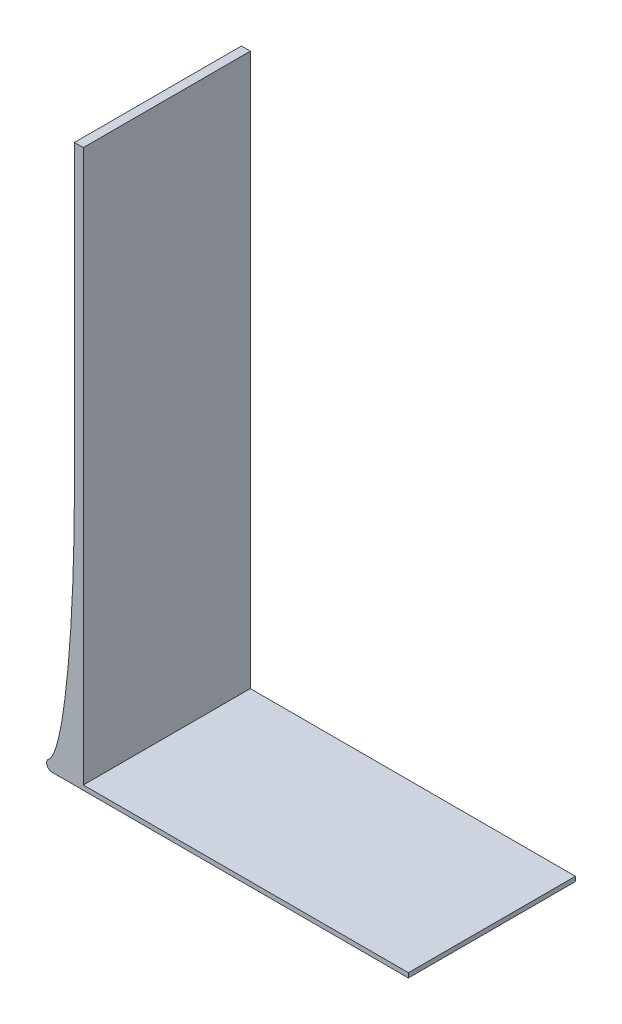
ISO-10303-21;
HEADER;
FILE_DESCRIPTION(('STEP AP214'),'2;1');
FILE_NAME('part.step','',(''),(''),'','','');
FILE_SCHEMA(('AUTOMOTIVE_DESIGN { 1 0 10303 214 1 1 1 1 }'));
ENDSEC;
DATA;
#1=APPLICATION_CONTEXT('core data for automotive mechanical design processes');
#2=APPLICATION_PROTOCOL_DEFINITION('international standard','automotive_design',2000,#1);
#3=PRODUCT_CONTEXT('',#1,'mechanical');
#4=PRODUCT('Part','Part','',(#3));
#5=PRODUCT_RELATED_PRODUCT_CATEGORY('part','',(#4));
#6=PRODUCT_DEFINITION_FORMATION('','',#4);
#7=PRODUCT_DEFINITION_CONTEXT('part definition',#1,'design');
#8=PRODUCT_DEFINITION('design','',#6,#7);
#9=PRODUCT_DEFINITION_SHAPE('','',#8);
#10=(LENGTH_UNIT() NAMED_UNIT(*) SI_UNIT(.MILLI.,.METRE.));
#11=(NAMED_UNIT(*) PLANE_ANGLE_UNIT() SI_UNIT($,.RADIAN.));
#12=(NAMED_UNIT(*) SI_UNIT($,.STERADIAN.) SOLID_ANGLE_UNIT());
#13=UNCERTAINTY_MEASURE_WITH_UNIT(LENGTH_MEASURE(1.E-05),#10,'distance_accuracy_value','');
#14=(GEOMETRIC_REPRESENTATION_CONTEXT(3) GLOBAL_UNCERTAINTY_ASSIGNED_CONTEXT((#13)) GLOBAL_UNIT_ASSIGNED_CONTEXT((#10,
#11,#12)) REPRESENTATION_CONTEXT('',''));
#15=CARTESIAN_POINT('',(0.,0.,0.));
#16=DIRECTION('',(0.,0.,1.));
#17=DIRECTION('',(1.,0.,0.));
#18=AXIS2_PLACEMENT_3D('',#15,#16,#17);
#19=CARTESIAN_POINT('',(0.,1.65,60.));
#20=DIRECTION('',(0.,1.,0.));
#21=DIRECTION('',(0.,0.,1.));
#22=AXIS2_PLACEMENT_3D('',#19,#20,#21);
#23=PLANE('',#22);
#24=DIRECTION('',(1.,0.,0.));
#25=VECTOR('',#24,1.);
#26=CARTESIAN_POINT('',(0.,1.65,0.));
#27=LINE('',#26,#25);
#28=CARTESIAN_POINT('',(3.2,1.65,0.));
#29=VERTEX_POINT('',#28);
#30=CARTESIAN_POINT('',(120.,1.65,0.));
#31=VERTEX_POINT('',#30);
#32=EDGE_CURVE('E188',#29,#31,#27,.T.);
#33=ORIENTED_EDGE('',*,*,#32,.F.);
#34=DIRECTION('',(0.,0.,1.));
#35=VECTOR('',#34,1.);
#36=CARTESIAN_POINT('',(3.2,1.65,60.));
#37=LINE('',#36,#35);
#38=CARTESIAN_POINT('',(3.2,1.65,60.));
#39=VERTEX_POINT('',#38);
#40=EDGE_CURVE('E159',#29,#39,#37,.T.);
#41=ORIENTED_EDGE('',*,*,#40,.T.);
#42=DIRECTION('',(1.,0.,0.));
#43=VECTOR('',#42,1.);
#44=CARTESIAN_POINT('',(0.,1.65,60.));
#45=LINE('',#44,#43);
#46=CARTESIAN_POINT('',(120.,1.65,60.));
#47=VERTEX_POINT('',#46);
#48=EDGE_CURVE('E146',#39,#47,#45,.T.);
#49=ORIENTED_EDGE('',*,*,#48,.T.);
#50=DIRECTION('',(0.,0.,-1.));
#51=VECTOR('',#50,1.);
#52=CARTESIAN_POINT('',(120.,1.65,60.));
#53=LINE('',#52,#51);
#54=EDGE_CURVE('E192',#47,#31,#53,.T.);
#55=ORIENTED_EDGE('',*,*,#54,.T.);
#56=EDGE_LOOP('',(#33,#41,#49,#55));
#57=FACE_BOUND('',#56,.T.);
#58=ADVANCED_FACE('F67',(#57),#23,.T.);
#59=CARTESIAN_POINT('',(0.,0.,60.));
#60=DIRECTION('',(0.,1.,0.));
#61=DIRECTION('',(0.,0.,1.));
#62=AXIS2_PLACEMENT_3D('',#59,#60,#61);
#63=PLANE('',#62);
#64=DIRECTION('',(1.,0.,0.));
#65=VECTOR('',#64,1.);
#66=CARTESIAN_POINT('',(0.,0.,60.));
#67=LINE('',#66,#65);
#68=CARTESIAN_POINT('',(-8.,0.,60.));
#69=VERTEX_POINT('',#68);
#70=CARTESIAN_POINT('',(120.,0.,60.));
#71=VERTEX_POINT('',#70);
#72=EDGE_CURVE('E185',#69,#71,#67,.T.);
#73=ORIENTED_EDGE('',*,*,#72,.F.);
#74=DIRECTION('',(0.,0.,-1.));
#75=VECTOR('',#74,1.);
#76=CARTESIAN_POINT('',(-8.,0.,0.));
#77=LINE('',#76,#75);
#78=CARTESIAN_POINT('',(-8.,0.,0.));
#79=VERTEX_POINT('',#78);
#80=EDGE_CURVE('E213',#69,#79,#77,.T.);
#81=ORIENTED_EDGE('',*,*,#80,.T.);
#82=DIRECTION('',(1.,0.,0.));
#83=VECTOR('',#82,1.);
#84=CARTESIAN_POINT('',(0.,0.,0.));
#85=LINE('',#84,#83);
#86=CARTESIAN_POINT('',(120.,0.,0.));
#87=VERTEX_POINT('',#86);
#88=EDGE_CURVE('E184',#79,#87,#85,.T.);
#89=ORIENTED_EDGE('',*,*,#88,.T.);
#90=DIRECTION('',(0.,0.,-1.));
#91=VECTOR('',#90,1.);
#92=CARTESIAN_POINT('',(120.,0.,60.));
#93=LINE('',#92,#91);
#94=EDGE_CURVE('E174',#71,#87,#93,.T.);
#95=ORIENTED_EDGE('',*,*,#94,.F.);
#96=EDGE_LOOP('',(#73,#81,#89,#95));
#97=FACE_BOUND('',#96,.T.);
#98=ADVANCED_FACE('F253',(#97),#63,.F.);
#99=CARTESIAN_POINT('',(120.,1.65,60.));
#100=DIRECTION('',(1.,0.,0.));
#101=DIRECTION('',(0.,0.,-1.));
#102=AXIS2_PLACEMENT_3D('',#99,#100,#101);
#103=PLANE('',#102);
#104=DIRECTION('',(0.,-1.,0.));
#105=VECTOR('',#104,1.);
#106=CARTESIAN_POINT('',(120.,1.65,0.));
#107=LINE('',#106,#105);
#108=EDGE_CURVE('E194',#31,#87,#107,.T.);
#109=ORIENTED_EDGE('',*,*,#108,.F.);
#110=ORIENTED_EDGE('',*,*,#54,.F.);
#111=DIRECTION('',(0.,-1.,0.));
#112=VECTOR('',#111,1.);
#113=CARTESIAN_POINT('',(120.,1.65,60.));
#114=LINE('',#113,#112);
#115=EDGE_CURVE('E187',#47,#71,#114,.T.);
#116=ORIENTED_EDGE('',*,*,#115,.T.);
#117=ORIENTED_EDGE('',*,*,#94,.T.);
#118=EDGE_LOOP('',(#109,#110,#116,#117));
#119=FACE_BOUND('',#118,.T.);
#120=ADVANCED_FACE('F254',(#119),#103,.T.);
#121=CARTESIAN_POINT('',(0.,0.,60.));
#122=DIRECTION('',(0.,0.,-1.));
#123=DIRECTION('',(-1.,0.,0.));
#124=AXIS2_PLACEMENT_3D('',#121,#122,#123);
#125=PLANE('',#124);
#126=CARTESIAN_POINT('',(-8.00000000000001,1.91675235510532,60.));
#127=DIRECTION('',(0.,0.,-1.));
#128=DIRECTION('',(-1.,0.,0.));
#129=AXIS2_PLACEMENT_3D('',#126,#127,#128);
#130=CIRCLE('',#129,2.);
#131=CARTESIAN_POINT('',(-9.19087207248773,3.51696670228949,60.));
#132=VERTEX_POINT('',#131);
#133=CARTESIAN_POINT('',(-9.99956681743944,1.95837617755283,60.));
#134=VERTEX_POINT('',#133);
#135=EDGE_CURVE('E84',#132,#134,#130,.F.);
#136=ORIENTED_EDGE('',*,*,#135,.T.);
#137=CARTESIAN_POINT('',(-8.,2.,60.));
#138=DIRECTION('',(0.,0.,-1.));
#139=DIRECTION('',(-1.,0.,0.));
#140=AXIS2_PLACEMENT_3D('',#137,#138,#139);
#141=CIRCLE('',#140,2.);
#142=EDGE_CURVE('E76',#134,#69,#141,.F.);
#143=ORIENTED_EDGE('',*,*,#142,.T.);
#144=ORIENTED_EDGE('',*,*,#72,.T.);
#145=ORIENTED_EDGE('',*,*,#115,.F.);
#146=ORIENTED_EDGE('',*,*,#48,.F.);
#147=DIRECTION('',(0.,1.,0.));
#148=VECTOR('',#147,1.);
#149=CARTESIAN_POINT('',(3.2,0.,60.));
#150=LINE('',#149,#148);
#151=CARTESIAN_POINT('',(3.2,200.,60.));
#152=VERTEX_POINT('',#151);
#153=EDGE_CURVE('E139',#39,#152,#150,.T.);
#154=ORIENTED_EDGE('',*,*,#153,.T.);
#155=DIRECTION('',(1.,0.,0.));
#156=VECTOR('',#155,1.);
#157=CARTESIAN_POINT('',(0.,200.,60.));
#158=LINE('',#157,#156);
#159=CARTESIAN_POINT('',(0.,200.,60.));
#160=VERTEX_POINT('',#159);
#161=EDGE_CURVE('E144',#160,#152,#158,.T.);
#162=ORIENTED_EDGE('',*,*,#161,.F.);
#163=DIRECTION('',(0.,1.,0.));
#164=VECTOR('',#163,1.);
#165=CARTESIAN_POINT('',(0.,0.,60.));
#166=LINE('',#165,#164);
#167=CARTESIAN_POINT('',(0.,93.0610037780571,60.));
#168=VERTEX_POINT('',#167);
#169=EDGE_CURVE('E165',#168,#160,#166,.T.);
#170=ORIENTED_EDGE('',*,*,#169,.F.);
#171=CARTESIAN_POINT('',(-10.,3.19999999999999,60.));
#172=CARTESIAN_POINT('',(0.,3.75641488407465,60.));
#173=CARTESIAN_POINT('',(0.,93.0610037780571,60.));
#174=(BOUNDED_CURVE() B_SPLINE_CURVE(2,(#171,#172,#173),.UNSPECIFIED.,.F.,
.F.) B_SPLINE_CURVE_WITH_KNOTS((3,3),(0.,1.),
.UNSPECIFIED.) CURVE() GEOMETRIC_REPRESENTATION_ITEM() RATIONAL_B_SPLINE_CURVE((1.,
0.726483157256779,1.)) REPRESENTATION_ITEM(''));
#175=EDGE_CURVE('E210',#168,#132,#174,.F.);
#176=ORIENTED_EDGE('',*,*,#175,.T.);
#177=EDGE_LOOP('',(#136,#143,#144,#145,#146,#154,#162,#170,#176));
#178=FACE_BOUND('',#177,.T.);
#179=ADVANCED_FACE('F141',(#178),#125,.F.);
#180=CARTESIAN_POINT('',(0.,0.,0.));
#181=DIRECTION('',(0.,0.,-1.));
#182=DIRECTION('',(-1.,0.,0.));
#183=AXIS2_PLACEMENT_3D('',#180,#181,#182);
#184=PLANE('',#183);
#185=ORIENTED_EDGE('',*,*,#88,.F.);
#186=CARTESIAN_POINT('',(-8.,2.,0.));
#187=DIRECTION('',(0.,0.,-1.));
#188=DIRECTION('',(-1.,0.,0.));
#189=AXIS2_PLACEMENT_3D('',#186,#187,#188);
#190=CIRCLE('',#189,2.);
#191=CARTESIAN_POINT('',(-9.99956681743944,1.95837617755283,0.));
#192=VERTEX_POINT('',#191);
#193=EDGE_CURVE('E222',#79,#192,#190,.T.);
#194=ORIENTED_EDGE('',*,*,#193,.T.);
#195=CARTESIAN_POINT('',(-8.00000000000001,1.91675235510532,0.));
#196=DIRECTION('',(0.,0.,-1.));
#197=DIRECTION('',(-1.,0.,0.));
#198=AXIS2_PLACEMENT_3D('',#195,#196,#197);
#199=CIRCLE('',#198,2.);
#200=CARTESIAN_POINT('',(-9.19102304676027,3.51725253857817,0.));
#201=VERTEX_POINT('',#200);
#202=EDGE_CURVE('E216',#192,#201,#199,.T.);
#203=ORIENTED_EDGE('',*,*,#202,.T.);
#204=CARTESIAN_POINT('',(0.,93.0610037780571,0.));
#205=CARTESIAN_POINT('',(0.,3.75641488407465,0.));
#206=CARTESIAN_POINT('',(-10.,3.19999999999999,0.));
#207=(BOUNDED_CURVE() B_SPLINE_CURVE(2,(#204,#205,#206),.UNSPECIFIED.,.F.,
.F.) B_SPLINE_CURVE_WITH_KNOTS((3,3),(0.,1.),
.UNSPECIFIED.) CURVE() GEOMETRIC_REPRESENTATION_ITEM() RATIONAL_B_SPLINE_CURVE((1.,
0.726483157256779,1.)) REPRESENTATION_ITEM(''));
#208=CARTESIAN_POINT('',(0.,93.0610037780571,0.));
#209=VERTEX_POINT('',#208);
#210=EDGE_CURVE('E206',#201,#209,#207,.F.);
#211=ORIENTED_EDGE('',*,*,#210,.T.);
#212=DIRECTION('',(0.,1.,0.));
#213=VECTOR('',#212,1.);
#214=CARTESIAN_POINT('',(0.,0.,0.));
#215=LINE('',#214,#213);
#216=CARTESIAN_POINT('',(0.,200.,0.));
#217=VERTEX_POINT('',#216);
#218=EDGE_CURVE('E149',#209,#217,#215,.T.);
#219=ORIENTED_EDGE('',*,*,#218,.T.);
#220=DIRECTION('',(1.,0.,0.));
#221=VECTOR('',#220,1.);
#222=CARTESIAN_POINT('',(0.,200.,0.));
#223=LINE('',#222,#221);
#224=CARTESIAN_POINT('',(3.2,200.,0.));
#225=VERTEX_POINT('',#224);
#226=EDGE_CURVE('E178',#217,#225,#223,.T.);
#227=ORIENTED_EDGE('',*,*,#226,.T.);
#228=DIRECTION('',(0.,1.,0.));
#229=VECTOR('',#228,1.);
#230=CARTESIAN_POINT('',(3.2,0.,0.));
#231=LINE('',#230,#229);
#232=EDGE_CURVE('E155',#29,#225,#231,.T.);
#233=ORIENTED_EDGE('',*,*,#232,.F.);
#234=ORIENTED_EDGE('',*,*,#32,.T.);
#235=ORIENTED_EDGE('',*,*,#108,.T.);
#236=EDGE_LOOP('',(#185,#194,#203,#211,#219,#227,#233,#234,#235));
#237=FACE_BOUND('',#236,.T.);
#238=ADVANCED_FACE('F238',(#237),#184,.T.);
#239=CARTESIAN_POINT('',(3.2,0.,60.));
#240=DIRECTION('',(-1.,0.,0.));
#241=DIRECTION('',(0.,0.,1.));
#242=AXIS2_PLACEMENT_3D('',#239,#240,#241);
#243=PLANE('',#242);
#244=ORIENTED_EDGE('',*,*,#40,.F.);
#245=ORIENTED_EDGE('',*,*,#232,.T.);
#246=DIRECTION('',(0.,0.,-1.));
#247=VECTOR('',#246,1.);
#248=CARTESIAN_POINT('',(3.2,200.,60.));
#249=LINE('',#248,#247);
#250=EDGE_CURVE('E152',#152,#225,#249,.T.);
#251=ORIENTED_EDGE('',*,*,#250,.F.);
#252=ORIENTED_EDGE('',*,*,#153,.F.);
#253=EDGE_LOOP('',(#244,#245,#251,#252));
#254=FACE_BOUND('',#253,.T.);
#255=ADVANCED_FACE('F153',(#254),#243,.F.);
#256=CARTESIAN_POINT('',(0.,200.,60.));
#257=DIRECTION('',(0.,1.,0.));
#258=DIRECTION('',(0.,0.,1.));
#259=AXIS2_PLACEMENT_3D('',#256,#257,#258);
#260=PLANE('',#259);
#261=ORIENTED_EDGE('',*,*,#226,.F.);
#262=DIRECTION('',(0.,0.,-1.));
#263=VECTOR('',#262,1.);
#264=CARTESIAN_POINT('',(0.,200.,60.));
#265=LINE('',#264,#263);
#266=EDGE_CURVE('E160',#160,#217,#265,.T.);
#267=ORIENTED_EDGE('',*,*,#266,.F.);
#268=ORIENTED_EDGE('',*,*,#161,.T.);
#269=ORIENTED_EDGE('',*,*,#250,.T.);
#270=EDGE_LOOP('',(#261,#267,#268,#269));
#271=FACE_BOUND('',#270,.T.);
#272=ADVANCED_FACE('F163',(#271),#260,.T.);
#273=CARTESIAN_POINT('',(0.,0.,60.));
#274=DIRECTION('',(-1.,0.,0.));
#275=DIRECTION('',(0.,0.,1.));
#276=AXIS2_PLACEMENT_3D('',#273,#274,#275);
#277=PLANE('',#276);
#278=ORIENTED_EDGE('',*,*,#218,.F.);
#279=CARTESIAN_POINT('',(0.,93.0610037780571,63.));
#280=CARTESIAN_POINT('',(0.,93.0610037780571,41.));
#281=CARTESIAN_POINT('',(0.,93.0610037780571,19.));
#282=CARTESIAN_POINT('',(0.,93.0610037780571,-3.));
#283=(BOUNDED_CURVE() B_SPLINE_CURVE(3,(#279,#280,#281,#282),.UNSPECIFIED.,.F.,
.F.) B_SPLINE_CURVE_WITH_KNOTS((4,4),(-0.003,0.063),
.UNSPECIFIED.) CURVE() GEOMETRIC_REPRESENTATION_ITEM() RATIONAL_B_SPLINE_CURVE((1.,1.,1.,1.)) REPRESENTATION_ITEM(''));
#284=EDGE_CURVE('E203',#209,#168,#283,.F.);
#285=ORIENTED_EDGE('',*,*,#284,.T.);
#286=ORIENTED_EDGE('',*,*,#169,.T.);
#287=ORIENTED_EDGE('',*,*,#266,.T.);
#288=EDGE_LOOP('',(#278,#285,#286,#287));
#289=FACE_BOUND('',#288,.T.);
#290=ADVANCED_FACE('F248',(#289),#277,.T.);
#291=CARTESIAN_POINT('',(-10.,3.19999999999999,63.));
#292=CARTESIAN_POINT('',(-10.,3.19999999999999,41.));
#293=CARTESIAN_POINT('',(-10.,3.19999999999999,19.));
#294=CARTESIAN_POINT('',(-10.,3.19999999999999,-3.));
#295=CARTESIAN_POINT('',(0.,3.75641488407465,63.));
#296=CARTESIAN_POINT('',(0.,3.75641488407465,41.));
#297=CARTESIAN_POINT('',(0.,3.75641488407465,19.));
#298=CARTESIAN_POINT('',(0.,3.75641488407465,-3.));
#299=CARTESIAN_POINT('',(0.,93.0610037780571,63.));
#300=CARTESIAN_POINT('',(0.,93.0610037780571,41.));
#301=CARTESIAN_POINT('',(0.,93.0610037780571,19.));
#302=CARTESIAN_POINT('',(0.,93.0610037780571,-3.));
#303=(BOUNDED_SURFACE() B_SPLINE_SURFACE(2,3,((#291,#292,#293,#294),(#295,#296,#297,#298),(#299,
#300,#301,#302)),.UNSPECIFIED.,.F.,.F.,.F.) B_SPLINE_SURFACE_WITH_KNOTS((3,3),(4,4),(0.,1.),
(-0.003,0.063),.UNSPECIFIED.) GEOMETRIC_REPRESENTATION_ITEM() RATIONAL_B_SPLINE_SURFACE(((1.,1.,
1.,1.),(0.726483157256779,0.726483157256779,0.726483157256779,0.726483157256779),(1.,1.,1.,1.))) REPRESENTATION_ITEM('') SURFACE());
#304=DIRECTION('',(0.,0.,-1.));
#305=VECTOR('',#304,1.);
#306=CARTESIAN_POINT('',(-9.19387995443092,3.52132415294051,0.));
#307=LINE('',#306,#305);
#308=EDGE_CURVE('E13',#201,#132,#307,.F.);
#309=ORIENTED_EDGE('',*,*,#210,.F.);
#310=ORIENTED_EDGE('',*,*,#308,.T.);
#311=ORIENTED_EDGE('',*,*,#175,.F.);
#312=ORIENTED_EDGE('',*,*,#284,.F.);
#313=EDGE_LOOP('',(#309,#310,#311,#312));
#314=FACE_BOUND('',#313,.T.);
#315=ADVANCED_FACE('F259',(#314),#303,.T.);
#316=CARTESIAN_POINT('',(-8.00000000000001,1.91675235510532,30.));
#317=DIRECTION('',(0.,0.,-1.));
#318=DIRECTION('',(-1.,0.,0.));
#319=AXIS2_PLACEMENT_3D('',#316,#317,#318);
#320=CYLINDRICAL_SURFACE('',#319,2.);
#321=DIRECTION('',(0.,0.,-1.));
#322=VECTOR('',#321,1.);
#323=CARTESIAN_POINT('',(-9.99956681743944,1.95837617755283,30.));
#324=LINE('',#323,#322);
#325=EDGE_CURVE('E71',#134,#192,#324,.T.);
#326=ORIENTED_EDGE('',*,*,#325,.F.);
#327=ORIENTED_EDGE('',*,*,#135,.F.);
#328=ORIENTED_EDGE('',*,*,#308,.F.);
#329=ORIENTED_EDGE('',*,*,#202,.F.);
#330=EDGE_LOOP('',(#326,#327,#328,#329));
#331=FACE_BOUND('',#330,.T.);
#332=ADVANCED_FACE('F69',(#331),#320,.T.);
#333=CARTESIAN_POINT('',(-8.,2.,60.));
#334=DIRECTION('',(0.,0.,1.));
#335=DIRECTION('',(1.,0.,0.));
#336=AXIS2_PLACEMENT_3D('',#333,#334,#335);
#337=CYLINDRICAL_SURFACE('',#336,2.);
#338=ORIENTED_EDGE('',*,*,#142,.F.);
#339=ORIENTED_EDGE('',*,*,#325,.T.);
#340=ORIENTED_EDGE('',*,*,#193,.F.);
#341=ORIENTED_EDGE('',*,*,#80,.F.);
#342=EDGE_LOOP('',(#338,#339,#340,#341));
#343=FACE_BOUND('',#342,.T.);
#344=ADVANCED_FACE('F266',(#343),#337,.T.);
#345=CLOSED_SHELL('',(#58,#98,#120,#179,#238,#255,#272,#290,#315,#332,#344));
#346=MANIFOLD_SOLID_BREP('B2',#345);
#347=ADVANCED_BREP_SHAPE_REPRESENTATION('',(#18,#346),#14);
#348=SHAPE_DEFINITION_REPRESENTATION(#9,#347);
ENDSEC;
END-ISO-10303-21;
